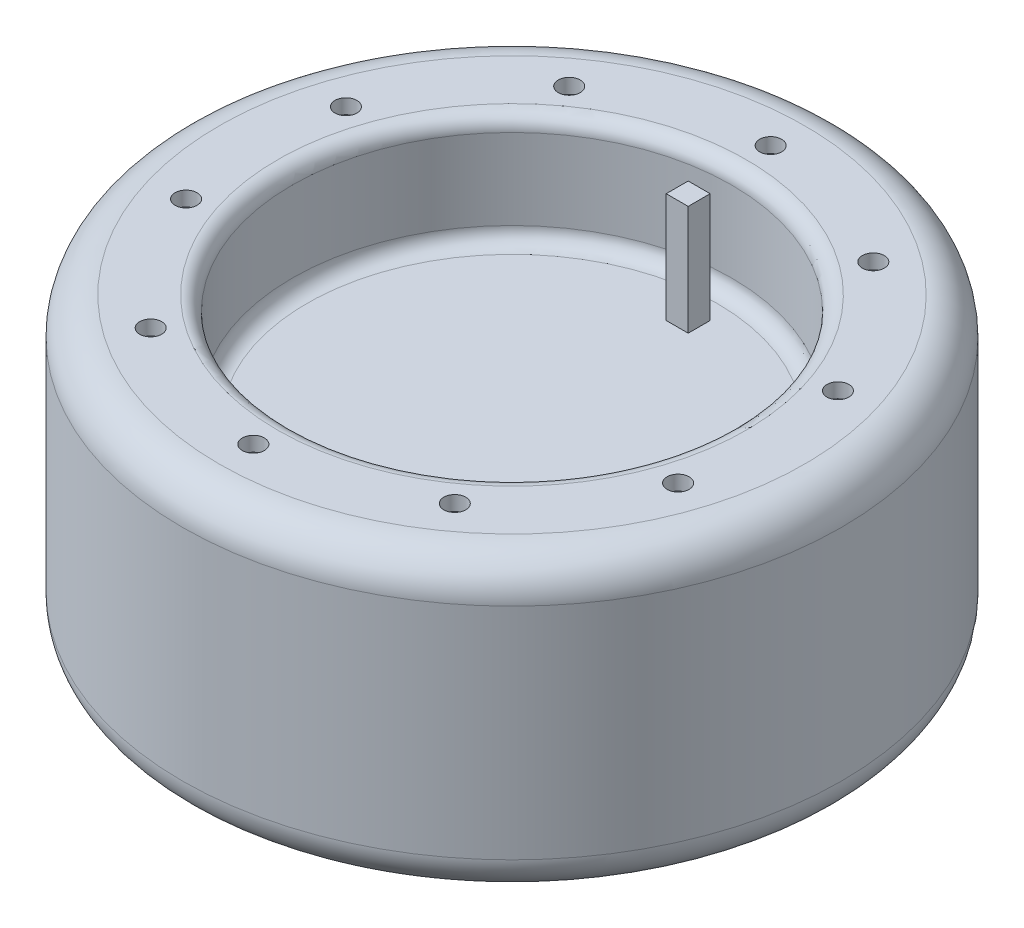
ISO-10303-21;
HEADER;
FILE_DESCRIPTION(('STEP AP214'),'2;1');
FILE_NAME('part.step','',(''),(''),'','','');
FILE_SCHEMA(('AUTOMOTIVE_DESIGN { 1 0 10303 214 1 1 1 1 }'));
ENDSEC;
DATA;
#1=APPLICATION_CONTEXT('core data for automotive mechanical design processes');
#2=APPLICATION_PROTOCOL_DEFINITION('international standard','automotive_design',2000,#1);
#3=PRODUCT_CONTEXT('',#1,'mechanical');
#4=PRODUCT('Part','Part','',(#3));
#5=PRODUCT_RELATED_PRODUCT_CATEGORY('part','',(#4));
#6=PRODUCT_DEFINITION_FORMATION('','',#4);
#7=PRODUCT_DEFINITION_CONTEXT('part definition',#1,'design');
#8=PRODUCT_DEFINITION('design','',#6,#7);
#9=PRODUCT_DEFINITION_SHAPE('','',#8);
#10=(LENGTH_UNIT() NAMED_UNIT(*) SI_UNIT(.MILLI.,.METRE.));
#11=(NAMED_UNIT(*) PLANE_ANGLE_UNIT() SI_UNIT($,.RADIAN.));
#12=(NAMED_UNIT(*) SI_UNIT($,.STERADIAN.) SOLID_ANGLE_UNIT());
#13=UNCERTAINTY_MEASURE_WITH_UNIT(LENGTH_MEASURE(1.E-05),#10,'distance_accuracy_value','');
#14=(GEOMETRIC_REPRESENTATION_CONTEXT(3) GLOBAL_UNCERTAINTY_ASSIGNED_CONTEXT((#13)) GLOBAL_UNIT_ASSIGNED_CONTEXT((#10,
#11,#12)) REPRESENTATION_CONTEXT('',''));
#15=CARTESIAN_POINT('',(0.,0.,0.));
#16=DIRECTION('',(0.,0.,1.));
#17=DIRECTION('',(1.,0.,0.));
#18=AXIS2_PLACEMENT_3D('',#15,#16,#17);
#19=CARTESIAN_POINT('',(0.,25.,0.));
#20=DIRECTION('',(0.,1.,0.));
#21=DIRECTION('',(0.,0.,1.));
#22=AXIS2_PLACEMENT_3D('',#19,#20,#21);
#23=PLANE('',#22);
#24=CARTESIAN_POINT('',(0.,25.,0.));
#25=DIRECTION('',(0.,1.,0.));
#26=DIRECTION('',(0.,0.,1.));
#27=AXIS2_PLACEMENT_3D('',#24,#25,#26);
#28=CIRCLE('',#27,28.);
#29=CARTESIAN_POINT('',(0.,25.,28.));
#30=VERTEX_POINT('',#29);
#31=EDGE_CURVE('E183',#30,#30,#28,.T.);
#32=ORIENTED_EDGE('',*,*,#31,.T.);
#33=EDGE_LOOP('',(#32));
#34=FACE_BOUND('',#33,.T.);
#35=DIRECTION('',(-1.,0.,0.));
#36=VECTOR('',#35,1.);
#37=CARTESIAN_POINT('',(-1.44070496863488,25.,-25.5));
#38=LINE('',#37,#36);
#39=CARTESIAN_POINT('',(1.55929503136512,25.,-25.5));
#40=VERTEX_POINT('',#39);
#41=CARTESIAN_POINT('',(-1.44070496863488,25.,-25.5));
#42=VERTEX_POINT('',#41);
#43=EDGE_CURVE('E98',#40,#42,#38,.T.);
#44=ORIENTED_EDGE('',*,*,#43,.F.);
#45=DIRECTION('',(0.,0.,-1.));
#46=VECTOR('',#45,1.);
#47=CARTESIAN_POINT('',(1.55929503136512,25.,-25.5));
#48=LINE('',#47,#46);
#49=CARTESIAN_POINT('',(1.55929503136512,25.,-22.5));
#50=VERTEX_POINT('',#49);
#51=EDGE_CURVE('E96',#50,#40,#48,.T.);
#52=ORIENTED_EDGE('',*,*,#51,.F.);
#53=DIRECTION('',(1.,0.,0.));
#54=VECTOR('',#53,1.);
#55=CARTESIAN_POINT('',(-1.44070496863488,25.,-22.5));
#56=LINE('',#55,#54);
#57=CARTESIAN_POINT('',(-1.44070496863488,25.,-22.5));
#58=VERTEX_POINT('',#57);
#59=EDGE_CURVE('E103',#58,#50,#56,.T.);
#60=ORIENTED_EDGE('',*,*,#59,.F.);
#61=DIRECTION('',(0.,0.,1.));
#62=VECTOR('',#61,1.);
#63=CARTESIAN_POINT('',(-1.44070496863488,25.,-25.5));
#64=LINE('',#63,#62);
#65=EDGE_CURVE('E52',#42,#58,#64,.T.);
#66=ORIENTED_EDGE('',*,*,#65,.F.);
#67=EDGE_LOOP('',(#44,#52,#60,#66));
#68=FACE_BOUND('',#67,.T.);
#69=ADVANCED_FACE('F37',(#34,#68),#23,.T.);
#70=CARTESIAN_POINT('',(0.,40.,0.));
#71=DIRECTION('',(0.,-1.,0.));
#72=DIRECTION('',(0.,0.,-1.));
#73=AXIS2_PLACEMENT_3D('',#70,#71,#72);
#74=CYLINDRICAL_SURFACE('',#73,45.);
#75=CARTESIAN_POINT('',(0.,35.,0.));
#76=DIRECTION('',(0.,1.,0.));
#77=DIRECTION('',(0.,0.,1.));
#78=AXIS2_PLACEMENT_3D('',#75,#76,#77);
#79=CIRCLE('',#78,45.);
#80=CARTESIAN_POINT('',(0.,35.,45.));
#81=VERTEX_POINT('',#80);
#82=EDGE_CURVE('E177',#81,#81,#79,.F.);
#83=ORIENTED_EDGE('',*,*,#82,.T.);
#84=EDGE_LOOP('',(#83));
#85=FACE_BOUND('',#84,.T.);
#86=CARTESIAN_POINT('',(0.,5.,0.));
#87=DIRECTION('',(0.,1.,0.));
#88=DIRECTION('',(0.,0.,1.));
#89=AXIS2_PLACEMENT_3D('',#86,#87,#88);
#90=CIRCLE('',#89,45.);
#91=CARTESIAN_POINT('',(0.,5.,45.));
#92=VERTEX_POINT('',#91);
#93=EDGE_CURVE('E174',#92,#92,#90,.T.);
#94=ORIENTED_EDGE('',*,*,#93,.T.);
#95=EDGE_LOOP('',(#94));
#96=FACE_BOUND('',#95,.T.);
#97=ADVANCED_FACE('F201',(#85,#96),#74,.T.);
#98=CARTESIAN_POINT('',(0.,40.,0.));
#99=DIRECTION('',(0.,1.,0.));
#100=DIRECTION('',(0.,0.,1.));
#101=AXIS2_PLACEMENT_3D('',#98,#99,#100);
#102=PLANE('',#101);
#103=CARTESIAN_POINT('',(0.,40.,-35.3240297490025));
#104=DIRECTION('',(0.,1.,0.));
#105=DIRECTION('',(0.,0.,1.));
#106=AXIS2_PLACEMENT_3D('',#103,#104,#105);
#107=CIRCLE('',#106,1.5);
#108=CARTESIAN_POINT('',(0.,40.,-33.8240297490025));
#109=VERTEX_POINT('',#108);
#110=EDGE_CURVE('E115',#109,#109,#107,.T.);
#111=ORIENTED_EDGE('',*,*,#110,.F.);
#112=EDGE_LOOP('',(#111));
#113=FACE_BOUND('',#112,.T.);
#114=CARTESIAN_POINT('',(-20.7629437380039,40.,-28.5777403767481));
#115=DIRECTION('',(0.,1.,0.));
#116=DIRECTION('',(0.,0.,1.));
#117=AXIS2_PLACEMENT_3D('',#114,#115,#116);
#118=CIRCLE('',#117,1.50000000000116);
#119=CARTESIAN_POINT('',(-20.7629437380039,40.,-27.0777403767469));
#120=VERTEX_POINT('',#119);
#121=EDGE_CURVE('E119',#120,#120,#118,.T.);
#122=ORIENTED_EDGE('',*,*,#121,.F.);
#123=EDGE_LOOP('',(#122));
#124=FACE_BOUND('',#123,.T.);
#125=CARTESIAN_POINT('',(-33.5951486745913,40.,-10.9157255022461));
#126=DIRECTION('',(0.,1.,0.));
#127=DIRECTION('',(0.,0.,1.));
#128=AXIS2_PLACEMENT_3D('',#125,#126,#127);
#129=CIRCLE('',#128,1.50000000000226);
#130=CARTESIAN_POINT('',(-33.5951486745913,40.,-9.41572550224381));
#131=VERTEX_POINT('',#130);
#132=EDGE_CURVE('E167',#131,#131,#129,.T.);
#133=ORIENTED_EDGE('',*,*,#132,.F.);
#134=EDGE_LOOP('',(#133));
#135=FACE_BOUND('',#134,.T.);
#136=CARTESIAN_POINT('',(-33.5951486745901,40.,10.9157255022499));
#137=DIRECTION('',(0.,1.,0.));
#138=DIRECTION('',(0.,0.,1.));
#139=AXIS2_PLACEMENT_3D('',#136,#137,#138);
#140=CIRCLE('',#139,1.50000000000338);
#141=CARTESIAN_POINT('',(-33.5951486745901,40.,12.4157255022533));
#142=VERTEX_POINT('',#141);
#143=EDGE_CURVE('E161',#142,#142,#140,.T.);
#144=ORIENTED_EDGE('',*,*,#143,.F.);
#145=EDGE_LOOP('',(#144));
#146=FACE_BOUND('',#145,.T.);
#147=CARTESIAN_POINT('',(-20.7629437380007,40.,28.5777403767504));
#148=DIRECTION('',(0.,1.,0.));
#149=DIRECTION('',(0.,0.,1.));
#150=AXIS2_PLACEMENT_3D('',#147,#148,#149);
#151=CIRCLE('',#150,1.5000000000041);
#152=CARTESIAN_POINT('',(-20.7629437380007,40.,30.0777403767545));
#153=VERTEX_POINT('',#152);
#154=EDGE_CURVE('E155',#153,#153,#151,.T.);
#155=ORIENTED_EDGE('',*,*,#154,.F.);
#156=EDGE_LOOP('',(#155));
#157=FACE_BOUND('',#156,.T.);
#158=CARTESIAN_POINT('',(4.00289939975885E-12,40.,35.3240297490025));
#159=DIRECTION('',(0.,1.,0.));
#160=DIRECTION('',(0.,0.,1.));
#161=AXIS2_PLACEMENT_3D('',#158,#159,#160);
#162=CIRCLE('',#161,1.50000000000407);
#163=CARTESIAN_POINT('',(4.00289939975885E-12,40.,36.8240297490066));
#164=VERTEX_POINT('',#163);
#165=EDGE_CURVE('E149',#164,#164,#162,.T.);
#166=ORIENTED_EDGE('',*,*,#165,.F.);
#167=EDGE_LOOP('',(#166));
#168=FACE_BOUND('',#167,.T.);
#169=CARTESIAN_POINT('',(20.7629437380079,40.,28.5777403767481));
#170=DIRECTION('',(0.,1.,0.));
#171=DIRECTION('',(0.,0.,1.));
#172=AXIS2_PLACEMENT_3D('',#169,#170,#171);
#173=CIRCLE('',#172,1.50000000000331);
#174=CARTESIAN_POINT('',(20.7629437380079,40.,30.0777403767514));
#175=VERTEX_POINT('',#174);
#176=EDGE_CURVE('E143',#175,#175,#173,.T.);
#177=ORIENTED_EDGE('',*,*,#176,.F.);
#178=EDGE_LOOP('',(#177));
#179=FACE_BOUND('',#178,.T.);
#180=CARTESIAN_POINT('',(33.5951486745953,40.,10.9157255022461));
#181=DIRECTION('',(0.,1.,0.));
#182=DIRECTION('',(0.,0.,1.));
#183=AXIS2_PLACEMENT_3D('',#180,#181,#182);
#184=CIRCLE('',#183,1.5000000000021);
#185=CARTESIAN_POINT('',(33.5951486745953,40.,12.4157255022482));
#186=VERTEX_POINT('',#185);
#187=EDGE_CURVE('E137',#186,#186,#184,.T.);
#188=ORIENTED_EDGE('',*,*,#187,.F.);
#189=EDGE_LOOP('',(#188));
#190=FACE_BOUND('',#189,.T.);
#191=CARTESIAN_POINT('',(33.5951486745941,40.,-10.9157255022499));
#192=DIRECTION('',(0.,1.,0.));
#193=DIRECTION('',(0.,0.,1.));
#194=AXIS2_PLACEMENT_3D('',#191,#192,#193);
#195=CIRCLE('',#194,1.50000000000086);
#196=CARTESIAN_POINT('',(33.5951486745941,40.,-9.41572550224903));
#197=VERTEX_POINT('',#196);
#198=EDGE_CURVE('E131',#197,#197,#195,.T.);
#199=ORIENTED_EDGE('',*,*,#198,.F.);
#200=EDGE_LOOP('',(#199));
#201=FACE_BOUND('',#200,.T.);
#202=CARTESIAN_POINT('',(20.7629437380046,40.,-28.5777403767504));
#203=DIRECTION('',(0.,1.,0.));
#204=DIRECTION('',(0.,0.,1.));
#205=AXIS2_PLACEMENT_3D('',#202,#203,#204);
#206=CIRCLE('',#205,1.50000000000007);
#207=CARTESIAN_POINT('',(20.7629437380046,40.,-27.0777403767503));
#208=VERTEX_POINT('',#207);
#209=EDGE_CURVE('E118',#208,#208,#206,.T.);
#210=ORIENTED_EDGE('',*,*,#209,.F.);
#211=EDGE_LOOP('',(#210));
#212=FACE_BOUND('',#211,.T.);
#213=CARTESIAN_POINT('',(0.,40.,0.));
#214=DIRECTION('',(0.,1.,0.));
#215=DIRECTION('',(0.,0.,1.));
#216=AXIS2_PLACEMENT_3D('',#213,#214,#215);
#217=CIRCLE('',#216,32.);
#218=CARTESIAN_POINT('',(0.,40.,32.));
#219=VERTEX_POINT('',#218);
#220=EDGE_CURVE('E11',#219,#219,#217,.F.);
#221=ORIENTED_EDGE('',*,*,#220,.T.);
#222=EDGE_LOOP('',(#221));
#223=FACE_BOUND('',#222,.T.);
#224=CARTESIAN_POINT('',(0.,40.,0.));
#225=DIRECTION('',(0.,1.,0.));
#226=DIRECTION('',(0.,0.,1.));
#227=AXIS2_PLACEMENT_3D('',#224,#225,#226);
#228=CIRCLE('',#227,40.);
#229=CARTESIAN_POINT('',(0.,40.,40.));
#230=VERTEX_POINT('',#229);
#231=EDGE_CURVE('E114',#230,#230,#228,.T.);
#232=ORIENTED_EDGE('',*,*,#231,.T.);
#233=EDGE_LOOP('',(#232));
#234=FACE_BOUND('',#233,.T.);
#235=ADVANCED_FACE('F306',(#113,#124,#135,#146,#157,#168,#179,#190,#201,#212,#223,#234),#102,.T.);
#236=CARTESIAN_POINT('',(0.,0.,0.));
#237=DIRECTION('',(0.,1.,0.));
#238=DIRECTION('',(0.,0.,1.));
#239=AXIS2_PLACEMENT_3D('',#236,#237,#238);
#240=PLANE('',#239);
#241=CARTESIAN_POINT('',(0.,0.,0.));
#242=DIRECTION('',(0.,1.,0.));
#243=DIRECTION('',(0.,0.,1.));
#244=AXIS2_PLACEMENT_3D('',#241,#242,#243);
#245=CIRCLE('',#244,40.);
#246=CARTESIAN_POINT('',(0.,0.,40.));
#247=VERTEX_POINT('',#246);
#248=EDGE_CURVE('E180',#247,#247,#245,.F.);
#249=ORIENTED_EDGE('',*,*,#248,.T.);
#250=EDGE_LOOP('',(#249));
#251=FACE_BOUND('',#250,.T.);
#252=ADVANCED_FACE('F309',(#251),#240,.F.);
#253=CARTESIAN_POINT('',(0.,35.,0.));
#254=DIRECTION('',(0.,1.,0.));
#255=DIRECTION('',(0.,0.,1.));
#256=AXIS2_PLACEMENT_3D('',#253,#254,#255);
#257=TOROIDAL_SURFACE('',#256,40.,5.);
#258=ORIENTED_EDGE('',*,*,#82,.F.);
#259=EDGE_LOOP('',(#258));
#260=FACE_BOUND('',#259,.T.);
#261=ORIENTED_EDGE('',*,*,#231,.F.);
#262=EDGE_LOOP('',(#261));
#263=FACE_BOUND('',#262,.T.);
#264=ADVANCED_FACE('F313',(#260,#263),#257,.T.);
#265=CARTESIAN_POINT('',(0.,5.,0.));
#266=DIRECTION('',(0.,1.,0.));
#267=DIRECTION('',(0.,0.,1.));
#268=AXIS2_PLACEMENT_3D('',#265,#266,#267);
#269=TOROIDAL_SURFACE('',#268,40.,5.);
#270=ORIENTED_EDGE('',*,*,#248,.F.);
#271=EDGE_LOOP('',(#270));
#272=FACE_BOUND('',#271,.T.);
#273=ORIENTED_EDGE('',*,*,#93,.F.);
#274=EDGE_LOOP('',(#273));
#275=FACE_BOUND('',#274,.T.);
#276=ADVANCED_FACE('F305',(#272,#275),#269,.T.);
#277=CARTESIAN_POINT('',(0.,25.,0.));
#278=DIRECTION('',(0.,1.,0.));
#279=DIRECTION('',(0.,0.,1.));
#280=AXIS2_PLACEMENT_3D('',#277,#278,#279);
#281=CYLINDRICAL_SURFACE('',#280,30.);
#282=CARTESIAN_POINT('',(0.,27.,0.));
#283=DIRECTION('',(0.,1.,0.));
#284=DIRECTION('',(0.,0.,1.));
#285=AXIS2_PLACEMENT_3D('',#282,#283,#284);
#286=CIRCLE('',#285,30.);
#287=CARTESIAN_POINT('',(0.,27.,30.));
#288=VERTEX_POINT('',#287);
#289=EDGE_CURVE('E45',#288,#288,#286,.F.);
#290=ORIENTED_EDGE('',*,*,#289,.T.);
#291=EDGE_LOOP('',(#290));
#292=FACE_BOUND('',#291,.T.);
#293=CARTESIAN_POINT('',(0.,38.,0.));
#294=DIRECTION('',(0.,1.,0.));
#295=DIRECTION('',(0.,0.,1.));
#296=AXIS2_PLACEMENT_3D('',#293,#294,#295);
#297=CIRCLE('',#296,30.);
#298=CARTESIAN_POINT('',(0.,38.,30.));
#299=VERTEX_POINT('',#298);
#300=EDGE_CURVE('E186',#299,#299,#297,.T.);
#301=ORIENTED_EDGE('',*,*,#300,.T.);
#302=EDGE_LOOP('',(#301));
#303=FACE_BOUND('',#302,.T.);
#304=ADVANCED_FACE('F191',(#292,#303),#281,.F.);
#305=CARTESIAN_POINT('',(0.,27.,0.));
#306=DIRECTION('',(0.,1.,0.));
#307=DIRECTION('',(0.,0.,1.));
#308=AXIS2_PLACEMENT_3D('',#305,#306,#307);
#309=TOROIDAL_SURFACE('',#308,28.,2.);
#310=ORIENTED_EDGE('',*,*,#289,.F.);
#311=EDGE_LOOP('',(#310));
#312=FACE_BOUND('',#311,.T.);
#313=ORIENTED_EDGE('',*,*,#31,.F.);
#314=EDGE_LOOP('',(#313));
#315=FACE_BOUND('',#314,.T.);
#316=ADVANCED_FACE('F194',(#312,#315),#309,.F.);
#317=CARTESIAN_POINT('',(0.,38.,0.));
#318=DIRECTION('',(0.,1.,0.));
#319=DIRECTION('',(0.,0.,1.));
#320=AXIS2_PLACEMENT_3D('',#317,#318,#319);
#321=TOROIDAL_SURFACE('',#320,32.,2.);
#322=ORIENTED_EDGE('',*,*,#220,.F.);
#323=EDGE_LOOP('',(#322));
#324=FACE_BOUND('',#323,.T.);
#325=ORIENTED_EDGE('',*,*,#300,.F.);
#326=EDGE_LOOP('',(#325));
#327=FACE_BOUND('',#326,.T.);
#328=ADVANCED_FACE('F39',(#324,#327),#321,.T.);
#329=CARTESIAN_POINT('',(20.7629437380046,38.,-28.5777403767504));
#330=DIRECTION('',(0.,1.,0.));
#331=DIRECTION('',(0.,0.,1.));
#332=AXIS2_PLACEMENT_3D('',#329,#330,#331);
#333=CYLINDRICAL_SURFACE('',#332,1.50000000000007);
#334=CARTESIAN_POINT('',(20.7629437380046,38.,-28.5777403767504));
#335=DIRECTION('',(0.,1.,0.));
#336=DIRECTION('',(0.,0.,1.));
#337=AXIS2_PLACEMENT_3D('',#334,#335,#336);
#338=CIRCLE('',#337,1.50000000000007);
#339=CARTESIAN_POINT('',(20.7629437380046,38.,-27.0777403767503));
#340=VERTEX_POINT('',#339);
#341=EDGE_CURVE('E128',#340,#340,#338,.T.);
#342=ORIENTED_EDGE('',*,*,#341,.F.);
#343=EDGE_LOOP('',(#342));
#344=FACE_BOUND('',#343,.T.);
#345=ORIENTED_EDGE('',*,*,#209,.T.);
#346=EDGE_LOOP('',(#345));
#347=FACE_BOUND('',#346,.T.);
#348=ADVANCED_FACE('F240',(#344,#347),#333,.F.);
#349=CARTESIAN_POINT('',(20.7629437380046,38.,-28.5777403767504));
#350=DIRECTION('',(0.,1.,0.));
#351=DIRECTION('',(0.,0.,1.));
#352=AXIS2_PLACEMENT_3D('',#349,#350,#351);
#353=PLANE('',#352);
#354=ORIENTED_EDGE('',*,*,#341,.T.);
#355=EDGE_LOOP('',(#354));
#356=FACE_BOUND('',#355,.T.);
#357=ADVANCED_FACE('F243',(#356),#353,.T.);
#358=CARTESIAN_POINT('',(33.5951486745941,38.,-10.9157255022499));
#359=DIRECTION('',(0.,1.,0.));
#360=DIRECTION('',(0.,0.,1.));
#361=AXIS2_PLACEMENT_3D('',#358,#359,#360);
#362=CYLINDRICAL_SURFACE('',#361,1.50000000000086);
#363=CARTESIAN_POINT('',(33.5951486745941,38.,-10.9157255022499));
#364=DIRECTION('',(0.,1.,0.));
#365=DIRECTION('',(0.,0.,1.));
#366=AXIS2_PLACEMENT_3D('',#363,#364,#365);
#367=CIRCLE('',#366,1.50000000000086);
#368=CARTESIAN_POINT('',(33.5951486745941,38.,-9.41572550224903));
#369=VERTEX_POINT('',#368);
#370=EDGE_CURVE('E134',#369,#369,#367,.T.);
#371=ORIENTED_EDGE('',*,*,#370,.F.);
#372=EDGE_LOOP('',(#371));
#373=FACE_BOUND('',#372,.T.);
#374=ORIENTED_EDGE('',*,*,#198,.T.);
#375=EDGE_LOOP('',(#374));
#376=FACE_BOUND('',#375,.T.);
#377=ADVANCED_FACE('F247',(#373,#376),#362,.F.);
#378=CARTESIAN_POINT('',(33.5951486745941,38.,-10.9157255022499));
#379=DIRECTION('',(0.,1.,0.));
#380=DIRECTION('',(0.,0.,1.));
#381=AXIS2_PLACEMENT_3D('',#378,#379,#380);
#382=PLANE('',#381);
#383=ORIENTED_EDGE('',*,*,#370,.T.);
#384=EDGE_LOOP('',(#383));
#385=FACE_BOUND('',#384,.T.);
#386=ADVANCED_FACE('F251',(#385),#382,.T.);
#387=CARTESIAN_POINT('',(33.5951486745953,38.,10.9157255022461));
#388=DIRECTION('',(0.,1.,0.));
#389=DIRECTION('',(0.,0.,1.));
#390=AXIS2_PLACEMENT_3D('',#387,#388,#389);
#391=CYLINDRICAL_SURFACE('',#390,1.5000000000021);
#392=CARTESIAN_POINT('',(33.5951486745953,38.,10.9157255022461));
#393=DIRECTION('',(0.,1.,0.));
#394=DIRECTION('',(0.,0.,1.));
#395=AXIS2_PLACEMENT_3D('',#392,#393,#394);
#396=CIRCLE('',#395,1.5000000000021);
#397=CARTESIAN_POINT('',(33.5951486745953,38.,12.4157255022482));
#398=VERTEX_POINT('',#397);
#399=EDGE_CURVE('E140',#398,#398,#396,.T.);
#400=ORIENTED_EDGE('',*,*,#399,.F.);
#401=EDGE_LOOP('',(#400));
#402=FACE_BOUND('',#401,.T.);
#403=ORIENTED_EDGE('',*,*,#187,.T.);
#404=EDGE_LOOP('',(#403));
#405=FACE_BOUND('',#404,.T.);
#406=ADVANCED_FACE('F255',(#402,#405),#391,.F.);
#407=CARTESIAN_POINT('',(33.5951486745953,38.,10.9157255022461));
#408=DIRECTION('',(0.,1.,0.));
#409=DIRECTION('',(0.,0.,1.));
#410=AXIS2_PLACEMENT_3D('',#407,#408,#409);
#411=PLANE('',#410);
#412=ORIENTED_EDGE('',*,*,#399,.T.);
#413=EDGE_LOOP('',(#412));
#414=FACE_BOUND('',#413,.T.);
#415=ADVANCED_FACE('F259',(#414),#411,.T.);
#416=CARTESIAN_POINT('',(20.7629437380079,38.,28.5777403767481));
#417=DIRECTION('',(0.,1.,0.));
#418=DIRECTION('',(0.,0.,1.));
#419=AXIS2_PLACEMENT_3D('',#416,#417,#418);
#420=CYLINDRICAL_SURFACE('',#419,1.50000000000331);
#421=CARTESIAN_POINT('',(20.7629437380079,38.,28.5777403767481));
#422=DIRECTION('',(0.,1.,0.));
#423=DIRECTION('',(0.,0.,1.));
#424=AXIS2_PLACEMENT_3D('',#421,#422,#423);
#425=CIRCLE('',#424,1.50000000000331);
#426=CARTESIAN_POINT('',(20.7629437380079,38.,30.0777403767514));
#427=VERTEX_POINT('',#426);
#428=EDGE_CURVE('E146',#427,#427,#425,.T.);
#429=ORIENTED_EDGE('',*,*,#428,.F.);
#430=EDGE_LOOP('',(#429));
#431=FACE_BOUND('',#430,.T.);
#432=ORIENTED_EDGE('',*,*,#176,.T.);
#433=EDGE_LOOP('',(#432));
#434=FACE_BOUND('',#433,.T.);
#435=ADVANCED_FACE('F263',(#431,#434),#420,.F.);
#436=CARTESIAN_POINT('',(20.7629437380079,38.,28.5777403767481));
#437=DIRECTION('',(0.,1.,0.));
#438=DIRECTION('',(0.,0.,1.));
#439=AXIS2_PLACEMENT_3D('',#436,#437,#438);
#440=PLANE('',#439);
#441=ORIENTED_EDGE('',*,*,#428,.T.);
#442=EDGE_LOOP('',(#441));
#443=FACE_BOUND('',#442,.T.);
#444=ADVANCED_FACE('F267',(#443),#440,.T.);
#445=CARTESIAN_POINT('',(4.00289939975885E-12,38.,35.3240297490025));
#446=DIRECTION('',(0.,1.,0.));
#447=DIRECTION('',(0.,0.,1.));
#448=AXIS2_PLACEMENT_3D('',#445,#446,#447);
#449=CYLINDRICAL_SURFACE('',#448,1.50000000000407);
#450=CARTESIAN_POINT('',(4.00289939975885E-12,38.,35.3240297490025));
#451=DIRECTION('',(0.,1.,0.));
#452=DIRECTION('',(0.,0.,1.));
#453=AXIS2_PLACEMENT_3D('',#450,#451,#452);
#454=CIRCLE('',#453,1.50000000000407);
#455=CARTESIAN_POINT('',(4.00289939975885E-12,38.,36.8240297490066));
#456=VERTEX_POINT('',#455);
#457=EDGE_CURVE('E152',#456,#456,#454,.T.);
#458=ORIENTED_EDGE('',*,*,#457,.F.);
#459=EDGE_LOOP('',(#458));
#460=FACE_BOUND('',#459,.T.);
#461=ORIENTED_EDGE('',*,*,#165,.T.);
#462=EDGE_LOOP('',(#461));
#463=FACE_BOUND('',#462,.T.);
#464=ADVANCED_FACE('F271',(#460,#463),#449,.F.);
#465=CARTESIAN_POINT('',(4.00289939975885E-12,38.,35.3240297490025));
#466=DIRECTION('',(0.,1.,0.));
#467=DIRECTION('',(0.,0.,1.));
#468=AXIS2_PLACEMENT_3D('',#465,#466,#467);
#469=PLANE('',#468);
#470=ORIENTED_EDGE('',*,*,#457,.T.);
#471=EDGE_LOOP('',(#470));
#472=FACE_BOUND('',#471,.T.);
#473=ADVANCED_FACE('F275',(#472),#469,.T.);
#474=CARTESIAN_POINT('',(-20.7629437380007,38.,28.5777403767504));
#475=DIRECTION('',(0.,1.,0.));
#476=DIRECTION('',(0.,0.,1.));
#477=AXIS2_PLACEMENT_3D('',#474,#475,#476);
#478=CYLINDRICAL_SURFACE('',#477,1.5000000000041);
#479=CARTESIAN_POINT('',(-20.7629437380007,38.,28.5777403767504));
#480=DIRECTION('',(0.,1.,0.));
#481=DIRECTION('',(0.,0.,1.));
#482=AXIS2_PLACEMENT_3D('',#479,#480,#481);
#483=CIRCLE('',#482,1.5000000000041);
#484=CARTESIAN_POINT('',(-20.7629437380007,38.,30.0777403767545));
#485=VERTEX_POINT('',#484);
#486=EDGE_CURVE('E158',#485,#485,#483,.T.);
#487=ORIENTED_EDGE('',*,*,#486,.F.);
#488=EDGE_LOOP('',(#487));
#489=FACE_BOUND('',#488,.T.);
#490=ORIENTED_EDGE('',*,*,#154,.T.);
#491=EDGE_LOOP('',(#490));
#492=FACE_BOUND('',#491,.T.);
#493=ADVANCED_FACE('F279',(#489,#492),#478,.F.);
#494=CARTESIAN_POINT('',(-20.7629437380007,38.,28.5777403767504));
#495=DIRECTION('',(0.,1.,0.));
#496=DIRECTION('',(0.,0.,1.));
#497=AXIS2_PLACEMENT_3D('',#494,#495,#496);
#498=PLANE('',#497);
#499=ORIENTED_EDGE('',*,*,#486,.T.);
#500=EDGE_LOOP('',(#499));
#501=FACE_BOUND('',#500,.T.);
#502=ADVANCED_FACE('F283',(#501),#498,.T.);
#503=CARTESIAN_POINT('',(-33.5951486745901,38.,10.9157255022499));
#504=DIRECTION('',(0.,1.,0.));
#505=DIRECTION('',(0.,0.,1.));
#506=AXIS2_PLACEMENT_3D('',#503,#504,#505);
#507=CYLINDRICAL_SURFACE('',#506,1.50000000000338);
#508=CARTESIAN_POINT('',(-33.5951486745901,38.,10.9157255022499));
#509=DIRECTION('',(0.,1.,0.));
#510=DIRECTION('',(0.,0.,1.));
#511=AXIS2_PLACEMENT_3D('',#508,#509,#510);
#512=CIRCLE('',#511,1.50000000000338);
#513=CARTESIAN_POINT('',(-33.5951486745901,38.,12.4157255022533));
#514=VERTEX_POINT('',#513);
#515=EDGE_CURVE('E164',#514,#514,#512,.T.);
#516=ORIENTED_EDGE('',*,*,#515,.F.);
#517=EDGE_LOOP('',(#516));
#518=FACE_BOUND('',#517,.T.);
#519=ORIENTED_EDGE('',*,*,#143,.T.);
#520=EDGE_LOOP('',(#519));
#521=FACE_BOUND('',#520,.T.);
#522=ADVANCED_FACE('F287',(#518,#521),#507,.F.);
#523=CARTESIAN_POINT('',(-33.5951486745901,38.,10.9157255022499));
#524=DIRECTION('',(0.,1.,0.));
#525=DIRECTION('',(0.,0.,1.));
#526=AXIS2_PLACEMENT_3D('',#523,#524,#525);
#527=PLANE('',#526);
#528=ORIENTED_EDGE('',*,*,#515,.T.);
#529=EDGE_LOOP('',(#528));
#530=FACE_BOUND('',#529,.T.);
#531=ADVANCED_FACE('F291',(#530),#527,.T.);
#532=CARTESIAN_POINT('',(-33.5951486745913,38.,-10.9157255022461));
#533=DIRECTION('',(0.,1.,0.));
#534=DIRECTION('',(0.,0.,1.));
#535=AXIS2_PLACEMENT_3D('',#532,#533,#534);
#536=CYLINDRICAL_SURFACE('',#535,1.50000000000226);
#537=CARTESIAN_POINT('',(-33.5951486745913,38.,-10.9157255022461));
#538=DIRECTION('',(0.,1.,0.));
#539=DIRECTION('',(0.,0.,1.));
#540=AXIS2_PLACEMENT_3D('',#537,#538,#539);
#541=CIRCLE('',#540,1.50000000000226);
#542=CARTESIAN_POINT('',(-33.5951486745913,38.,-9.41572550224381));
#543=VERTEX_POINT('',#542);
#544=EDGE_CURVE('E122',#543,#543,#541,.T.);
#545=ORIENTED_EDGE('',*,*,#544,.F.);
#546=EDGE_LOOP('',(#545));
#547=FACE_BOUND('',#546,.T.);
#548=ORIENTED_EDGE('',*,*,#132,.T.);
#549=EDGE_LOOP('',(#548));
#550=FACE_BOUND('',#549,.T.);
#551=ADVANCED_FACE('F295',(#547,#550),#536,.F.);
#552=CARTESIAN_POINT('',(-33.5951486745913,38.,-10.9157255022461));
#553=DIRECTION('',(0.,1.,0.));
#554=DIRECTION('',(0.,0.,1.));
#555=AXIS2_PLACEMENT_3D('',#552,#553,#554);
#556=PLANE('',#555);
#557=ORIENTED_EDGE('',*,*,#544,.T.);
#558=EDGE_LOOP('',(#557));
#559=FACE_BOUND('',#558,.T.);
#560=ADVANCED_FACE('F235',(#559),#556,.T.);
#561=CARTESIAN_POINT('',(-20.7629437380039,38.,-28.5777403767481));
#562=DIRECTION('',(0.,1.,0.));
#563=DIRECTION('',(0.,0.,1.));
#564=AXIS2_PLACEMENT_3D('',#561,#562,#563);
#565=CYLINDRICAL_SURFACE('',#564,1.50000000000116);
#566=CARTESIAN_POINT('',(-20.7629437380039,38.,-28.5777403767481));
#567=DIRECTION('',(0.,1.,0.));
#568=DIRECTION('',(0.,0.,1.));
#569=AXIS2_PLACEMENT_3D('',#566,#567,#568);
#570=CIRCLE('',#569,1.50000000000116);
#571=CARTESIAN_POINT('',(-20.7629437380039,38.,-27.0777403767469));
#572=VERTEX_POINT('',#571);
#573=EDGE_CURVE('E123',#572,#572,#570,.T.);
#574=ORIENTED_EDGE('',*,*,#573,.F.);
#575=EDGE_LOOP('',(#574));
#576=FACE_BOUND('',#575,.T.);
#577=ORIENTED_EDGE('',*,*,#121,.T.);
#578=EDGE_LOOP('',(#577));
#579=FACE_BOUND('',#578,.T.);
#580=ADVANCED_FACE('F232',(#576,#579),#565,.F.);
#581=CARTESIAN_POINT('',(-20.7629437380039,38.,-28.5777403767481));
#582=DIRECTION('',(0.,1.,0.));
#583=DIRECTION('',(0.,0.,1.));
#584=AXIS2_PLACEMENT_3D('',#581,#582,#583);
#585=PLANE('',#584);
#586=ORIENTED_EDGE('',*,*,#573,.T.);
#587=EDGE_LOOP('',(#586));
#588=FACE_BOUND('',#587,.T.);
#589=ADVANCED_FACE('F230',(#588),#585,.T.);
#590=CARTESIAN_POINT('',(0.,38.,-35.3240297490025));
#591=DIRECTION('',(0.,1.,0.));
#592=DIRECTION('',(0.,0.,1.));
#593=AXIS2_PLACEMENT_3D('',#590,#591,#592);
#594=CYLINDRICAL_SURFACE('',#593,1.5);
#595=CARTESIAN_POINT('',(0.,38.,-35.3240297490025));
#596=DIRECTION('',(0.,1.,0.));
#597=DIRECTION('',(0.,0.,1.));
#598=AXIS2_PLACEMENT_3D('',#595,#596,#597);
#599=CIRCLE('',#598,1.5);
#600=CARTESIAN_POINT('',(0.,38.,-33.8240297490025));
#601=VERTEX_POINT('',#600);
#602=EDGE_CURVE('E111',#601,#601,#599,.T.);
#603=ORIENTED_EDGE('',*,*,#602,.F.);
#604=EDGE_LOOP('',(#603));
#605=FACE_BOUND('',#604,.T.);
#606=ORIENTED_EDGE('',*,*,#110,.T.);
#607=EDGE_LOOP('',(#606));
#608=FACE_BOUND('',#607,.T.);
#609=ADVANCED_FACE('F226',(#605,#608),#594,.F.);
#610=CARTESIAN_POINT('',(0.,38.,-35.3240297490025));
#611=DIRECTION('',(0.,1.,0.));
#612=DIRECTION('',(0.,0.,1.));
#613=AXIS2_PLACEMENT_3D('',#610,#611,#612);
#614=PLANE('',#613);
#615=ORIENTED_EDGE('',*,*,#602,.T.);
#616=EDGE_LOOP('',(#615));
#617=FACE_BOUND('',#616,.T.);
#618=ADVANCED_FACE('F222',(#617),#614,.T.);
#619=CARTESIAN_POINT('',(1.55929503136512,44.2426406871193,-25.5));
#620=DIRECTION('',(-1.,0.,0.));
#621=DIRECTION('',(0.,0.,1.));
#622=AXIS2_PLACEMENT_3D('',#619,#620,#621);
#623=PLANE('',#622);
#624=DIRECTION('',(0.,0.,-1.));
#625=VECTOR('',#624,1.);
#626=CARTESIAN_POINT('',(1.55929503136512,40.,-25.5));
#627=LINE('',#626,#625);
#628=CARTESIAN_POINT('',(1.55929503136512,40.,-22.5));
#629=VERTEX_POINT('',#628);
#630=CARTESIAN_POINT('',(1.55929503136512,40.,-25.5));
#631=VERTEX_POINT('',#630);
#632=EDGE_CURVE('E90',#629,#631,#627,.T.);
#633=ORIENTED_EDGE('',*,*,#632,.F.);
#634=DIRECTION('',(0.,-1.,0.));
#635=VECTOR('',#634,1.);
#636=CARTESIAN_POINT('',(1.55929503136512,44.2426406871193,-22.5));
#637=LINE('',#636,#635);
#638=EDGE_CURVE('E60',#629,#50,#637,.T.);
#639=ORIENTED_EDGE('',*,*,#638,.T.);
#640=ORIENTED_EDGE('',*,*,#51,.T.);
#641=DIRECTION('',(0.,-1.,0.));
#642=VECTOR('',#641,1.);
#643=CARTESIAN_POINT('',(1.55929503136512,44.2426406871193,-25.5));
#644=LINE('',#643,#642);
#645=EDGE_CURVE('E83',#631,#40,#644,.T.);
#646=ORIENTED_EDGE('',*,*,#645,.F.);
#647=EDGE_LOOP('',(#633,#639,#640,#646));
#648=FACE_BOUND('',#647,.T.);
#649=ADVANCED_FACE('F93',(#648),#623,.F.);
#650=CARTESIAN_POINT('',(-1.44070496863488,44.2426406871193,-25.5));
#651=DIRECTION('',(0.,0.,1.));
#652=DIRECTION('',(1.,0.,0.));
#653=AXIS2_PLACEMENT_3D('',#650,#651,#652);
#654=PLANE('',#653);
#655=DIRECTION('',(-1.,0.,0.));
#656=VECTOR('',#655,1.);
#657=CARTESIAN_POINT('',(-1.44070496863488,40.,-25.5));
#658=LINE('',#657,#656);
#659=CARTESIAN_POINT('',(-1.44070496863488,40.,-25.5));
#660=VERTEX_POINT('',#659);
#661=EDGE_CURVE('E79',#631,#660,#658,.T.);
#662=ORIENTED_EDGE('',*,*,#661,.F.);
#663=ORIENTED_EDGE('',*,*,#645,.T.);
#664=ORIENTED_EDGE('',*,*,#43,.T.);
#665=DIRECTION('',(0.,-1.,0.));
#666=VECTOR('',#665,1.);
#667=CARTESIAN_POINT('',(-1.44070496863488,44.2426406871193,-25.5));
#668=LINE('',#667,#666);
#669=EDGE_CURVE('E85',#660,#42,#668,.T.);
#670=ORIENTED_EDGE('',*,*,#669,.F.);
#671=EDGE_LOOP('',(#662,#663,#664,#670));
#672=FACE_BOUND('',#671,.T.);
#673=ADVANCED_FACE('F81',(#672),#654,.F.);
#674=CARTESIAN_POINT('',(-1.44070496863488,44.2426406871193,-25.5));
#675=DIRECTION('',(1.,0.,0.));
#676=DIRECTION('',(0.,0.,-1.));
#677=AXIS2_PLACEMENT_3D('',#674,#675,#676);
#678=PLANE('',#677);
#679=DIRECTION('',(0.,0.,1.));
#680=VECTOR('',#679,1.);
#681=CARTESIAN_POINT('',(-1.44070496863488,40.,-25.5));
#682=LINE('',#681,#680);
#683=CARTESIAN_POINT('',(-1.44070496863488,40.,-22.5));
#684=VERTEX_POINT('',#683);
#685=EDGE_CURVE('E89',#660,#684,#682,.T.);
#686=ORIENTED_EDGE('',*,*,#685,.F.);
#687=ORIENTED_EDGE('',*,*,#669,.T.);
#688=ORIENTED_EDGE('',*,*,#65,.T.);
#689=DIRECTION('',(0.,-1.,0.));
#690=VECTOR('',#689,1.);
#691=CARTESIAN_POINT('',(-1.44070496863488,44.2426406871193,-22.5));
#692=LINE('',#691,#690);
#693=EDGE_CURVE('E108',#684,#58,#692,.T.);
#694=ORIENTED_EDGE('',*,*,#693,.F.);
#695=EDGE_LOOP('',(#686,#687,#688,#694));
#696=FACE_BOUND('',#695,.T.);
#697=ADVANCED_FACE('F208',(#696),#678,.F.);
#698=CARTESIAN_POINT('',(-1.44070496863488,44.2426406871193,-22.5));
#699=DIRECTION('',(0.,0.,-1.));
#700=DIRECTION('',(-1.,0.,0.));
#701=AXIS2_PLACEMENT_3D('',#698,#699,#700);
#702=PLANE('',#701);
#703=DIRECTION('',(1.,0.,0.));
#704=VECTOR('',#703,1.);
#705=CARTESIAN_POINT('',(-1.44070496863488,40.,-22.5));
#706=LINE('',#705,#704);
#707=EDGE_CURVE('E101',#684,#629,#706,.T.);
#708=ORIENTED_EDGE('',*,*,#707,.F.);
#709=ORIENTED_EDGE('',*,*,#693,.T.);
#710=ORIENTED_EDGE('',*,*,#59,.T.);
#711=ORIENTED_EDGE('',*,*,#638,.F.);
#712=EDGE_LOOP('',(#708,#709,#710,#711));
#713=FACE_BOUND('',#712,.T.);
#714=ADVANCED_FACE('F209',(#713),#702,.F.);
#715=CARTESIAN_POINT('',(0.,40.,0.));
#716=DIRECTION('',(0.,1.,0.));
#717=DIRECTION('',(0.,0.,1.));
#718=AXIS2_PLACEMENT_3D('',#715,#716,#717);
#719=PLANE('',#718);
#720=ORIENTED_EDGE('',*,*,#707,.T.);
#721=ORIENTED_EDGE('',*,*,#632,.T.);
#722=ORIENTED_EDGE('',*,*,#661,.T.);
#723=ORIENTED_EDGE('',*,*,#685,.T.);
#724=EDGE_LOOP('',(#720,#721,#722,#723));
#725=FACE_BOUND('',#724,.T.);
#726=ADVANCED_FACE('F100',(#725),#719,.T.);
#727=CLOSED_SHELL('',(#69,#97,#235,#252,#264,#276,#304,#316,#328,#348,#357,#377,#386,#406,#415,
#435,#444,#464,#473,#493,#502,#522,#531,#551,#560,#580,#589,#609,#618,#649,#673,#697,#714,#726));
#728=MANIFOLD_SOLID_BREP('B2',#727);
#729=ADVANCED_BREP_SHAPE_REPRESENTATION('',(#18,#728),#14);
#730=SHAPE_DEFINITION_REPRESENTATION(#9,#729);
ENDSEC;
END-ISO-10303-21;
